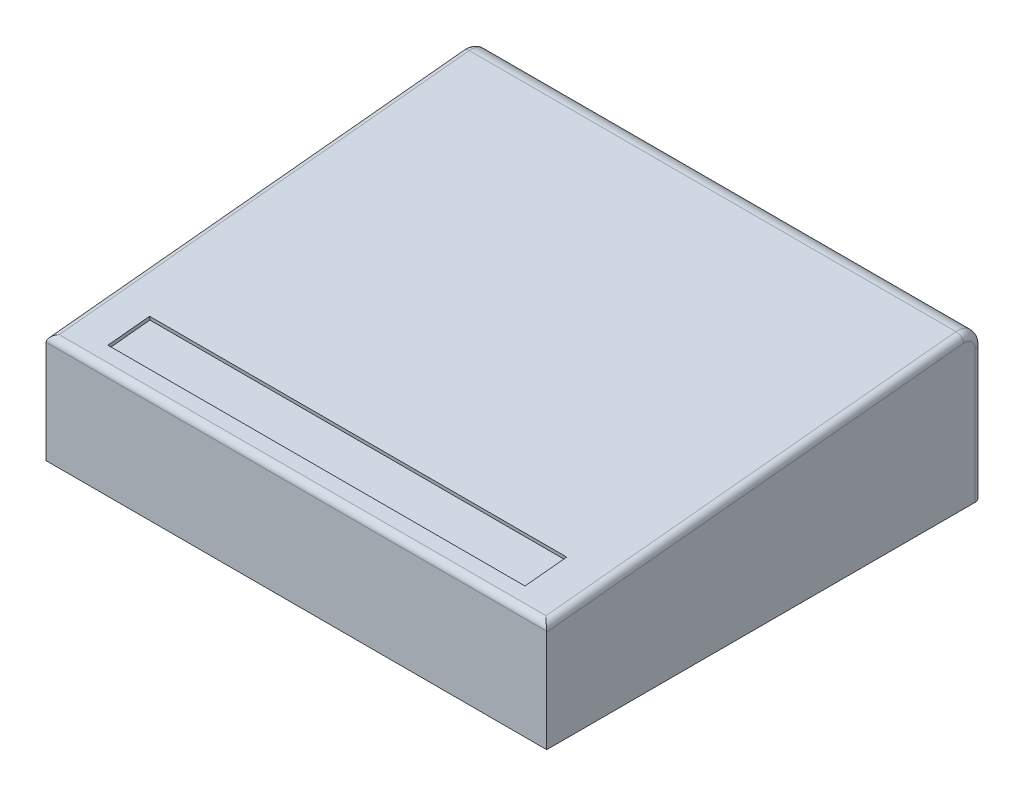
ISO-10303-21;
HEADER;
FILE_DESCRIPTION(('STEP AP214'),'2;1');
FILE_NAME('part.step','',(''),(''),'','','');
FILE_SCHEMA(('AUTOMOTIVE_DESIGN { 1 0 10303 214 1 1 1 1 }'));
ENDSEC;
DATA;
#1=APPLICATION_CONTEXT('core data for automotive mechanical design processes');
#2=APPLICATION_PROTOCOL_DEFINITION('international standard','automotive_design',2000,#1);
#3=PRODUCT_CONTEXT('',#1,'mechanical');
#4=PRODUCT('Part','Part','',(#3));
#5=PRODUCT_RELATED_PRODUCT_CATEGORY('part','',(#4));
#6=PRODUCT_DEFINITION_FORMATION('','',#4);
#7=PRODUCT_DEFINITION_CONTEXT('part definition',#1,'design');
#8=PRODUCT_DEFINITION('design','',#6,#7);
#9=PRODUCT_DEFINITION_SHAPE('','',#8);
#10=(LENGTH_UNIT() NAMED_UNIT(*) SI_UNIT(.MILLI.,.METRE.));
#11=(NAMED_UNIT(*) PLANE_ANGLE_UNIT() SI_UNIT($,.RADIAN.));
#12=(NAMED_UNIT(*) SI_UNIT($,.STERADIAN.) SOLID_ANGLE_UNIT());
#13=UNCERTAINTY_MEASURE_WITH_UNIT(LENGTH_MEASURE(1.E-05),#10,'distance_accuracy_value','');
#14=(GEOMETRIC_REPRESENTATION_CONTEXT(3) GLOBAL_UNCERTAINTY_ASSIGNED_CONTEXT((#13)) GLOBAL_UNIT_ASSIGNED_CONTEXT((#10,
#11,#12)) REPRESENTATION_CONTEXT('',''));
#15=CARTESIAN_POINT('',(0.,0.,0.));
#16=DIRECTION('',(0.,0.,1.));
#17=DIRECTION('',(1.,0.,0.));
#18=AXIS2_PLACEMENT_3D('',#15,#16,#17);
#19=CARTESIAN_POINT('',(18.25625,0.,0.));
#20=DIRECTION('',(0.,0.,-1.));
#21=DIRECTION('',(-1.,0.,0.));
#22=AXIS2_PLACEMENT_3D('',#19,#20,#21);
#23=PLANE('',#22);
#24=DIRECTION('',(0.,-1.,0.));
#25=VECTOR('',#24,1.);
#26=CARTESIAN_POINT('',(18.25625,0.,0.));
#27=LINE('',#26,#25);
#28=CARTESIAN_POINT('',(18.25625,3.71348315922353,0.));
#29=VERTEX_POINT('',#28);
#30=CARTESIAN_POINT('',(18.25625,0.,0.));
#31=VERTEX_POINT('',#30);
#32=EDGE_CURVE('E196',#29,#31,#27,.T.);
#33=ORIENTED_EDGE('',*,*,#32,.F.);
#34=CARTESIAN_POINT('',(18.00225,3.71348315922353,0.));
#35=DIRECTION('',(0.,0.,-1.));
#36=DIRECTION('',(0.,-1.,0.));
#37=AXIS2_PLACEMENT_3D('',#34,#35,#36);
#38=ELLIPSE('',#37,0.255266840776471,0.254);
#39=CARTESIAN_POINT('',(18.2549894463133,3.73888315922353,0.));
#40=VERTEX_POINT('',#39);
#41=EDGE_CURVE('E255',#29,#40,#38,.F.);
#42=ORIENTED_EDGE('',*,*,#41,.T.);
#43=DIRECTION('',(-1.,0.,0.));
#44=VECTOR('',#43,1.);
#45=CARTESIAN_POINT('',(18.25625,3.73888315922353,0.));
#46=LINE('',#45,#44);
#47=CARTESIAN_POINT('',(0.00126055368666195,3.73888315922353,0.));
#48=VERTEX_POINT('',#47);
#49=EDGE_CURVE('E252',#40,#48,#46,.T.);
#50=ORIENTED_EDGE('',*,*,#49,.T.);
#51=CARTESIAN_POINT('',(0.254000000000001,3.71348315922353,0.));
#52=DIRECTION('',(0.,0.,-1.));
#53=DIRECTION('',(0.,1.,0.));
#54=AXIS2_PLACEMENT_3D('',#51,#52,#53);
#55=ELLIPSE('',#54,0.255266840776471,0.254);
#56=CARTESIAN_POINT('',(0.,3.71348315922353,0.));
#57=VERTEX_POINT('',#56);
#58=EDGE_CURVE('E249',#48,#57,#55,.F.);
#59=ORIENTED_EDGE('',*,*,#58,.T.);
#60=DIRECTION('',(0.,-1.,0.));
#61=VECTOR('',#60,1.);
#62=CARTESIAN_POINT('',(0.,0.,0.));
#63=LINE('',#62,#61);
#64=CARTESIAN_POINT('',(0.,0.,0.));
#65=VERTEX_POINT('',#64);
#66=EDGE_CURVE('E205',#57,#65,#63,.T.);
#67=ORIENTED_EDGE('',*,*,#66,.T.);
#68=DIRECTION('',(-1.,0.,0.));
#69=VECTOR('',#68,1.);
#70=CARTESIAN_POINT('',(18.25625,0.,0.));
#71=LINE('',#70,#69);
#72=EDGE_CURVE('E212',#31,#65,#71,.T.);
#73=ORIENTED_EDGE('',*,*,#72,.F.);
#74=EDGE_LOOP('',(#33,#42,#50,#59,#67,#73));
#75=FACE_BOUND('',#74,.T.);
#76=ADVANCED_FACE('F41',(#75),#23,.F.);
#77=CARTESIAN_POINT('',(18.25625,0.,0.));
#78=DIRECTION('',(0.,1.,0.));
#79=DIRECTION('',(0.,0.,1.));
#80=AXIS2_PLACEMENT_3D('',#77,#78,#79);
#81=PLANE('',#80);
#82=DIRECTION('',(-1.,0.,0.));
#83=VECTOR('',#82,1.);
#84=CARTESIAN_POINT('',(18.25625,0.,-15.875));
#85=LINE('',#84,#83);
#86=CARTESIAN_POINT('',(18.00225,0.,-15.875));
#87=VERTEX_POINT('',#86);
#88=CARTESIAN_POINT('',(0.254000000000001,0.,-15.875));
#89=VERTEX_POINT('',#88);
#90=EDGE_CURVE('E204',#87,#89,#85,.T.);
#91=ORIENTED_EDGE('',*,*,#90,.F.);
#92=CARTESIAN_POINT('',(18.00225,0.,-15.621));
#93=DIRECTION('',(0.,1.,0.));
#94=DIRECTION('',(0.,0.,1.));
#95=AXIS2_PLACEMENT_3D('',#92,#93,#94);
#96=CIRCLE('',#95,0.254);
#97=CARTESIAN_POINT('',(18.25625,0.,-15.621));
#98=VERTEX_POINT('',#97);
#99=EDGE_CURVE('E11',#87,#98,#96,.F.);
#100=ORIENTED_EDGE('',*,*,#99,.T.);
#101=DIRECTION('',(0.,0.,-1.));
#102=VECTOR('',#101,1.);
#103=CARTESIAN_POINT('',(18.25625,0.,0.));
#104=LINE('',#103,#102);
#105=EDGE_CURVE('E199',#31,#98,#104,.T.);
#106=ORIENTED_EDGE('',*,*,#105,.F.);
#107=ORIENTED_EDGE('',*,*,#72,.T.);
#108=DIRECTION('',(0.,0.,-1.));
#109=VECTOR('',#108,1.);
#110=CARTESIAN_POINT('',(0.,0.,0.));
#111=LINE('',#110,#109);
#112=CARTESIAN_POINT('',(0.,0.,-15.621));
#113=VERTEX_POINT('',#112);
#114=EDGE_CURVE('E200',#65,#113,#111,.T.);
#115=ORIENTED_EDGE('',*,*,#114,.T.);
#116=CARTESIAN_POINT('',(0.254000000000001,0.,-15.621));
#117=DIRECTION('',(0.,1.,0.));
#118=DIRECTION('',(0.,0.,1.));
#119=AXIS2_PLACEMENT_3D('',#116,#117,#118);
#120=CIRCLE('',#119,0.254);
#121=EDGE_CURVE('E51',#113,#89,#120,.F.);
#122=ORIENTED_EDGE('',*,*,#121,.T.);
#123=EDGE_LOOP('',(#91,#100,#106,#107,#115,#122));
#124=FACE_BOUND('',#123,.T.);
#125=ADVANCED_FACE('F309',(#124),#81,.F.);
#126=CARTESIAN_POINT('',(18.25625,0.,-15.875));
#127=DIRECTION('',(0.,0.,1.));
#128=DIRECTION('',(1.,0.,0.));
#129=AXIS2_PLACEMENT_3D('',#126,#127,#128);
#130=PLANE('',#129);
#131=DIRECTION('',(-1.,0.,0.));
#132=VECTOR('',#131,1.);
#133=CARTESIAN_POINT('',(18.25625,4.85458289805882,-15.875));
#134=LINE('',#133,#132);
#135=CARTESIAN_POINT('',(0.254000000000001,4.85458289805882,-15.875));
#136=VERTEX_POINT('',#135);
#137=CARTESIAN_POINT('',(18.00225,4.85458289805882,-15.875));
#138=VERTEX_POINT('',#137);
#139=EDGE_CURVE('E220',#136,#138,#134,.F.);
#140=ORIENTED_EDGE('',*,*,#139,.T.);
#141=DIRECTION('',(0.,1.,0.));
#142=VECTOR('',#141,1.);
#143=CARTESIAN_POINT('',(18.00225,0.,-15.875));
#144=LINE('',#143,#142);
#145=EDGE_CURVE('E270',#138,#87,#144,.F.);
#146=ORIENTED_EDGE('',*,*,#145,.T.);
#147=ORIENTED_EDGE('',*,*,#90,.T.);
#148=DIRECTION('',(0.,1.,0.));
#149=VECTOR('',#148,1.);
#150=CARTESIAN_POINT('',(0.254000000000001,4.85458289805882,-15.875));
#151=LINE('',#150,#149);
#152=EDGE_CURVE('E267',#89,#136,#151,.T.);
#153=ORIENTED_EDGE('',*,*,#152,.T.);
#154=EDGE_LOOP('',(#140,#146,#147,#153));
#155=FACE_BOUND('',#154,.T.);
#156=ADVANCED_FACE('F347',(#155),#130,.F.);
#157=CARTESIAN_POINT('',(18.25625,3.96875,0.));
#158=DIRECTION('',(0.,-0.995037190209989,-0.0995037190209989));
#159=DIRECTION('',(0.,0.0995037190209989,-0.995037190209989));
#160=AXIS2_PLACEMENT_3D('',#157,#158,#159);
#161=PLANE('',#160);
#162=DIRECTION('',(1.,0.,0.));
#163=VECTOR('',#162,1.);
#164=CARTESIAN_POINT('',(16.73225,4.04194580883947,-0.731958088394647));
#165=LINE('',#164,#163);
#166=CARTESIAN_POINT('',(1.524,4.04194580883946,-0.731958088394647));
#167=VERTEX_POINT('',#166);
#168=CARTESIAN_POINT('',(16.73225,4.04194580883947,-0.731958088394647));
#169=VERTEX_POINT('',#168);
#170=EDGE_CURVE('E181',#167,#169,#165,.T.);
#171=ORIENTED_EDGE('',*,*,#170,.F.);
#172=DIRECTION('',(0.,-0.0995037190209988,0.995037190209989));
#173=VECTOR('',#172,1.);
#174=CARTESIAN_POINT('',(1.524,4.19403884854761,-2.25288848547606));
#175=LINE('',#174,#173);
#176=CARTESIAN_POINT('',(1.524,4.19403884854761,-2.25288848547606));
#177=VERTEX_POINT('',#176);
#178=EDGE_CURVE('E59',#177,#167,#175,.T.);
#179=ORIENTED_EDGE('',*,*,#178,.F.);
#180=DIRECTION('',(-1.,0.,0.));
#181=VECTOR('',#180,1.);
#182=CARTESIAN_POINT('',(16.73225,4.19403884854761,-2.25288848547606));
#183=LINE('',#182,#181);
#184=CARTESIAN_POINT('',(16.73225,4.19403884854761,-2.25288848547606));
#185=VERTEX_POINT('',#184);
#186=EDGE_CURVE('E168',#185,#177,#183,.T.);
#187=ORIENTED_EDGE('',*,*,#186,.F.);
#188=DIRECTION('',(0.,0.0995037190209988,-0.995037190209989));
#189=VECTOR('',#188,1.);
#190=CARTESIAN_POINT('',(16.73225,4.19403884854761,-2.25288848547606));
#191=LINE('',#190,#189);
#192=EDGE_CURVE('E172',#169,#185,#191,.T.);
#193=ORIENTED_EDGE('',*,*,#192,.F.);
#194=EDGE_LOOP('',(#171,#179,#187,#193));
#195=FACE_BOUND('',#194,.T.);
#196=DIRECTION('',(-1.,0.,0.));
#197=VECTOR('',#196,1.);
#198=CARTESIAN_POINT('',(18.25625,3.99162260553687,-0.228726055368666));
#199=LINE('',#198,#197);
#200=CARTESIAN_POINT('',(0.254000000000001,3.99162260553687,-0.228726055368666));
#201=VERTEX_POINT('',#200);
#202=CARTESIAN_POINT('',(18.00225,3.99162260553687,-0.228726055368666));
#203=VERTEX_POINT('',#202);
#204=EDGE_CURVE('E261',#201,#203,#199,.F.);
#205=ORIENTED_EDGE('',*,*,#204,.T.);
#206=DIRECTION('',(0.,-0.0995037190209989,0.995037190209989));
#207=VECTOR('',#206,1.);
#208=CARTESIAN_POINT('',(18.00225,3.96875,0.));
#209=LINE('',#208,#207);
#210=CARTESIAN_POINT('',(18.00225,5.48643151384217,-15.1768151384217));
#211=VERTEX_POINT('',#210);
#212=EDGE_CURVE('E264',#203,#211,#209,.F.);
#213=ORIENTED_EDGE('',*,*,#212,.T.);
#214=DIRECTION('',(-1.,0.,0.));
#215=VECTOR('',#214,1.);
#216=CARTESIAN_POINT('',(18.25625,5.48643151384217,-15.1768151384217));
#217=LINE('',#216,#215);
#218=CARTESIAN_POINT('',(0.254000000000001,5.48643151384217,-15.1768151384217));
#219=VERTEX_POINT('',#218);
#220=EDGE_CURVE('E216',#211,#219,#217,.T.);
#221=ORIENTED_EDGE('',*,*,#220,.T.);
#222=DIRECTION('',(0.,-0.0995037190209989,0.995037190209989));
#223=VECTOR('',#222,1.);
#224=CARTESIAN_POINT('',(0.254000000000001,3.96875,0.));
#225=LINE('',#224,#223);
#226=EDGE_CURVE('E258',#219,#201,#225,.T.);
#227=ORIENTED_EDGE('',*,*,#226,.T.);
#228=EDGE_LOOP('',(#205,#213,#221,#227));
#229=FACE_BOUND('',#228,.T.);
#230=ADVANCED_FACE('F325',(#195,#229),#161,.F.);
#231=CARTESIAN_POINT('',(18.25625,0.,0.));
#232=DIRECTION('',(-1.,0.,0.));
#233=DIRECTION('',(0.,0.,1.));
#234=AXIS2_PLACEMENT_3D('',#231,#232,#233);
#235=PLANE('',#234);
#236=CARTESIAN_POINT('',(18.25625,4.85458289805882,-15.24));
#237=DIRECTION('',(-1.,0.,0.));
#238=DIRECTION('',(0.,0.,1.));
#239=AXIS2_PLACEMENT_3D('',#236,#237,#238);
#240=CIRCLE('',#239,0.381);
#241=CARTESIAN_POINT('',(18.25625,4.85458289805882,-15.621));
#242=VERTEX_POINT('',#241);
#243=CARTESIAN_POINT('',(18.25625,5.23369206752883,-15.202089083053));
#244=VERTEX_POINT('',#243);
#245=EDGE_CURVE('E227',#242,#244,#240,.F.);
#246=ORIENTED_EDGE('',*,*,#245,.T.);
#247=DIRECTION('',(0.,-0.0995037190209989,0.995037190209989));
#248=VECTOR('',#247,1.);
#249=CARTESIAN_POINT('',(18.25625,3.67671599923122,0.367671599923122));
#250=LINE('',#249,#248);
#251=EDGE_CURVE('E231',#244,#29,#250,.T.);
#252=ORIENTED_EDGE('',*,*,#251,.T.);
#253=ORIENTED_EDGE('',*,*,#32,.T.);
#254=ORIENTED_EDGE('',*,*,#105,.T.);
#255=DIRECTION('',(0.,1.,0.));
#256=VECTOR('',#255,1.);
#257=CARTESIAN_POINT('',(18.25625,0.,-15.621));
#258=LINE('',#257,#256);
#259=EDGE_CURVE('E224',#98,#242,#258,.T.);
#260=ORIENTED_EDGE('',*,*,#259,.T.);
#261=EDGE_LOOP('',(#246,#252,#253,#254,#260));
#262=FACE_BOUND('',#261,.T.);
#263=ADVANCED_FACE('F340',(#262),#235,.F.);
#264=CARTESIAN_POINT('',(0.,0.,0.));
#265=DIRECTION('',(-1.,0.,0.));
#266=DIRECTION('',(0.,0.,1.));
#267=AXIS2_PLACEMENT_3D('',#264,#265,#266);
#268=PLANE('',#267);
#269=ORIENTED_EDGE('',*,*,#66,.F.);
#270=DIRECTION('',(0.,-0.0995037190209989,0.995037190209989));
#271=VECTOR('',#270,1.);
#272=CARTESIAN_POINT('',(0.,5.23369206752883,-15.202089083053));
#273=LINE('',#272,#271);
#274=CARTESIAN_POINT('',(0.,5.23369206752883,-15.202089083053));
#275=VERTEX_POINT('',#274);
#276=EDGE_CURVE('E246',#57,#275,#273,.F.);
#277=ORIENTED_EDGE('',*,*,#276,.T.);
#278=CARTESIAN_POINT('',(0.,4.85458289805882,-15.24));
#279=DIRECTION('',(-1.,0.,0.));
#280=DIRECTION('',(0.,0.,1.));
#281=AXIS2_PLACEMENT_3D('',#278,#279,#280);
#282=CIRCLE('',#281,0.381);
#283=CARTESIAN_POINT('',(0.,4.85458289805882,-15.621));
#284=VERTEX_POINT('',#283);
#285=EDGE_CURVE('E243',#275,#284,#282,.T.);
#286=ORIENTED_EDGE('',*,*,#285,.T.);
#287=DIRECTION('',(0.,1.,0.));
#288=VECTOR('',#287,1.);
#289=CARTESIAN_POINT('',(0.,0.,-15.621));
#290=LINE('',#289,#288);
#291=EDGE_CURVE('E240',#284,#113,#290,.F.);
#292=ORIENTED_EDGE('',*,*,#291,.T.);
#293=ORIENTED_EDGE('',*,*,#114,.F.);
#294=EDGE_LOOP('',(#269,#277,#286,#292,#293));
#295=FACE_BOUND('',#294,.T.);
#296=ADVANCED_FACE('F308',(#295),#268,.T.);
#297=CARTESIAN_POINT('',(18.25625,4.85458289805882,-15.24));
#298=DIRECTION('',(-1.,0.,0.));
#299=DIRECTION('',(0.,0.,1.));
#300=AXIS2_PLACEMENT_3D('',#297,#298,#299);
#301=CYLINDRICAL_SURFACE('',#300,0.635);
#302=ORIENTED_EDGE('',*,*,#220,.F.);
#303=CARTESIAN_POINT('',(18.00225,4.85458289805882,-15.24));
#304=DIRECTION('',(-1.,0.,0.));
#305=DIRECTION('',(0.,0.,1.));
#306=AXIS2_PLACEMENT_3D('',#303,#304,#305);
#307=CIRCLE('',#306,0.635);
#308=EDGE_CURVE('E237',#211,#138,#307,.T.);
#309=ORIENTED_EDGE('',*,*,#308,.T.);
#310=ORIENTED_EDGE('',*,*,#139,.F.);
#311=CARTESIAN_POINT('',(0.254000000000001,4.85458289805882,-15.24));
#312=DIRECTION('',(-1.,0.,0.));
#313=DIRECTION('',(0.,0.,1.));
#314=AXIS2_PLACEMENT_3D('',#311,#312,#313);
#315=CIRCLE('',#314,0.635);
#316=EDGE_CURVE('E234',#136,#219,#315,.F.);
#317=ORIENTED_EDGE('',*,*,#316,.T.);
#318=EDGE_LOOP('',(#302,#309,#310,#317));
#319=FACE_BOUND('',#318,.T.);
#320=ADVANCED_FACE('F329',(#319),#301,.T.);
#321=CARTESIAN_POINT('',(0.254000000000001,0.,-15.621));
#322=DIRECTION('',(0.,-1.,0.));
#323=DIRECTION('',(0.,0.,-1.));
#324=AXIS2_PLACEMENT_3D('',#321,#322,#323);
#325=CYLINDRICAL_SURFACE('',#324,0.254);
#326=ORIENTED_EDGE('',*,*,#121,.F.);
#327=ORIENTED_EDGE('',*,*,#291,.F.);
#328=CARTESIAN_POINT('',(0.254000000000001,4.85458289805882,-15.621));
#329=DIRECTION('',(0.,1.,0.));
#330=DIRECTION('',(0.,0.,1.));
#331=AXIS2_PLACEMENT_3D('',#328,#329,#330);
#332=CIRCLE('',#331,0.254);
#333=EDGE_CURVE('E45',#136,#284,#332,.T.);
#334=ORIENTED_EDGE('',*,*,#333,.F.);
#335=ORIENTED_EDGE('',*,*,#152,.F.);
#336=EDGE_LOOP('',(#326,#327,#334,#335));
#337=FACE_BOUND('',#336,.T.);
#338=ADVANCED_FACE('F43',(#337),#325,.T.);
#339=CARTESIAN_POINT('',(0.254000000000001,4.85458289805882,-15.24));
#340=DIRECTION('',(-1.,0.,0.));
#341=DIRECTION('',(0.,0.,1.));
#342=AXIS2_PLACEMENT_3D('',#339,#340,#341);
#343=TOROIDAL_SURFACE('',#342,0.381,0.254);
#344=ORIENTED_EDGE('',*,*,#333,.T.);
#345=ORIENTED_EDGE('',*,*,#285,.F.);
#346=CARTESIAN_POINT('',(0.254000000000001,5.23369206752883,-15.202089083053));
#347=DIRECTION('',(0.,-0.099503719021001,0.995037190209989));
#348=DIRECTION('',(0.,-0.995037190209989,-0.099503719021001));
#349=AXIS2_PLACEMENT_3D('',#346,#347,#348);
#350=CIRCLE('',#349,0.254);
#351=EDGE_CURVE('E288',#219,#275,#350,.T.);
#352=ORIENTED_EDGE('',*,*,#351,.F.);
#353=ORIENTED_EDGE('',*,*,#316,.F.);
#354=EDGE_LOOP('',(#344,#345,#352,#353));
#355=FACE_BOUND('',#354,.T.);
#356=ADVANCED_FACE('F301',(#355),#343,.T.);
#357=CARTESIAN_POINT('',(0.254000000000001,3.71601055368666,-0.0252739446313337));
#358=DIRECTION('',(0.,0.0995037190209989,-0.995037190209989));
#359=DIRECTION('',(0.,0.995037190209989,0.0995037190209989));
#360=AXIS2_PLACEMENT_3D('',#357,#358,#359);
#361=CYLINDRICAL_SURFACE('',#360,0.254);
#362=ORIENTED_EDGE('',*,*,#276,.F.);
#363=ORIENTED_EDGE('',*,*,#58,.F.);
#364=CARTESIAN_POINT('',(0.254000000000001,3.73888315922353,-0.254));
#365=DIRECTION('',(-0.707106781186547,0.0703597544730292,-0.703597544730292));
#366=DIRECTION('',(0.707106781186547,0.0703597544730292,-0.703597544730292));
#367=AXIS2_PLACEMENT_3D('',#364,#365,#366);
#368=ELLIPSE('',#367,0.359210244842766,0.254);
#369=EDGE_CURVE('E285',#201,#48,#368,.F.);
#370=ORIENTED_EDGE('',*,*,#369,.F.);
#371=ORIENTED_EDGE('',*,*,#226,.F.);
#372=ORIENTED_EDGE('',*,*,#351,.T.);
#373=EDGE_LOOP('',(#362,#363,#370,#371,#372));
#374=FACE_BOUND('',#373,.T.);
#375=ADVANCED_FACE('F316',(#374),#361,.T.);
#376=CARTESIAN_POINT('',(18.25625,3.73888315922353,-0.254));
#377=DIRECTION('',(-1.,0.,0.));
#378=DIRECTION('',(0.,0.,1.));
#379=AXIS2_PLACEMENT_3D('',#376,#377,#378);
#380=CYLINDRICAL_SURFACE('',#379,0.254);
#381=ORIENTED_EDGE('',*,*,#369,.T.);
#382=ORIENTED_EDGE('',*,*,#49,.F.);
#383=CARTESIAN_POINT('',(18.00225,3.73888315922353,-0.254));
#384=DIRECTION('',(-0.707106781186547,-0.0703597544730292,0.703597544730292));
#385=DIRECTION('',(0.707106781186547,-0.0703597544730292,0.703597544730292));
#386=AXIS2_PLACEMENT_3D('',#383,#384,#385);
#387=ELLIPSE('',#386,0.359210244842766,0.254);
#388=EDGE_CURVE('E281',#203,#40,#387,.F.);
#389=ORIENTED_EDGE('',*,*,#388,.F.);
#390=ORIENTED_EDGE('',*,*,#204,.F.);
#391=EDGE_LOOP('',(#381,#382,#389,#390));
#392=FACE_BOUND('',#391,.T.);
#393=ADVANCED_FACE('F321',(#392),#380,.T.);
#394=CARTESIAN_POINT('',(18.00225,0.,-15.621));
#395=DIRECTION('',(0.,1.,0.));
#396=DIRECTION('',(0.,0.,1.));
#397=AXIS2_PLACEMENT_3D('',#394,#395,#396);
#398=CYLINDRICAL_SURFACE('',#397,0.254);
#399=ORIENTED_EDGE('',*,*,#99,.F.);
#400=ORIENTED_EDGE('',*,*,#145,.F.);
#401=CARTESIAN_POINT('',(18.00225,4.85458289805882,-15.621));
#402=DIRECTION('',(0.,1.,0.));
#403=DIRECTION('',(0.,0.,1.));
#404=AXIS2_PLACEMENT_3D('',#401,#402,#403);
#405=CIRCLE('',#404,0.254);
#406=EDGE_CURVE('E277',#242,#138,#405,.T.);
#407=ORIENTED_EDGE('',*,*,#406,.F.);
#408=ORIENTED_EDGE('',*,*,#259,.F.);
#409=EDGE_LOOP('',(#399,#400,#407,#408));
#410=FACE_BOUND('',#409,.T.);
#411=ADVANCED_FACE('F345',(#410),#398,.T.);
#412=CARTESIAN_POINT('',(18.00225,3.67671599923122,0.367671599923122));
#413=DIRECTION('',(0.,-0.0995037190209989,0.995037190209989));
#414=DIRECTION('',(0.,-0.995037190209989,-0.0995037190209989));
#415=AXIS2_PLACEMENT_3D('',#412,#413,#414);
#416=CYLINDRICAL_SURFACE('',#415,0.254);
#417=ORIENTED_EDGE('',*,*,#41,.F.);
#418=ORIENTED_EDGE('',*,*,#251,.F.);
#419=CARTESIAN_POINT('',(18.00225,5.23369206752883,-15.202089083053));
#420=DIRECTION('',(0.,0.099503719021001,-0.995037190209989));
#421=DIRECTION('',(0.,0.995037190209989,0.099503719021001));
#422=AXIS2_PLACEMENT_3D('',#419,#420,#421);
#423=CIRCLE('',#422,0.254);
#424=EDGE_CURVE('E190',#211,#244,#423,.T.);
#425=ORIENTED_EDGE('',*,*,#424,.F.);
#426=ORIENTED_EDGE('',*,*,#212,.F.);
#427=ORIENTED_EDGE('',*,*,#388,.T.);
#428=EDGE_LOOP('',(#417,#418,#425,#426,#427));
#429=FACE_BOUND('',#428,.T.);
#430=ADVANCED_FACE('F338',(#429),#416,.T.);
#431=CARTESIAN_POINT('',(18.00225,4.85458289805882,-15.24));
#432=DIRECTION('',(-1.,0.,0.));
#433=DIRECTION('',(0.,0.,1.));
#434=AXIS2_PLACEMENT_3D('',#431,#432,#433);
#435=TOROIDAL_SURFACE('',#434,0.381,0.254);
#436=ORIENTED_EDGE('',*,*,#406,.T.);
#437=ORIENTED_EDGE('',*,*,#308,.F.);
#438=ORIENTED_EDGE('',*,*,#424,.T.);
#439=ORIENTED_EDGE('',*,*,#245,.F.);
#440=EDGE_LOOP('',(#436,#437,#438,#439));
#441=FACE_BOUND('',#440,.T.);
#442=ADVANCED_FACE('F333',(#441),#435,.T.);
#443=CARTESIAN_POINT('',(1.524,4.06766912539094,-2.26552545779173));
#444=DIRECTION('',(-1.,0.,0.));
#445=DIRECTION('',(0.,0.,1.));
#446=AXIS2_PLACEMENT_3D('',#443,#444,#445);
#447=PLANE('',#446);
#448=ORIENTED_EDGE('',*,*,#178,.T.);
#449=DIRECTION('',(0.,0.995037190209989,0.0995037190209989));
#450=VECTOR('',#449,1.);
#451=CARTESIAN_POINT('',(1.524,3.9155760856828,-0.744595060710314));
#452=LINE('',#451,#450);
#453=CARTESIAN_POINT('',(1.524,3.9155760856828,-0.744595060710314));
#454=VERTEX_POINT('',#453);
#455=EDGE_CURVE('E143',#454,#167,#452,.T.);
#456=ORIENTED_EDGE('',*,*,#455,.F.);
#457=DIRECTION('',(0.,-0.0995037190209988,0.995037190209989));
#458=VECTOR('',#457,1.);
#459=CARTESIAN_POINT('',(1.524,4.06766912539094,-2.26552545779173));
#460=LINE('',#459,#458);
#461=CARTESIAN_POINT('',(1.524,4.06766912539094,-2.26552545779173));
#462=VERTEX_POINT('',#461);
#463=EDGE_CURVE('E147',#462,#454,#460,.T.);
#464=ORIENTED_EDGE('',*,*,#463,.F.);
#465=DIRECTION('',(0.,0.995037190209989,0.0995037190209989));
#466=VECTOR('',#465,1.);
#467=CARTESIAN_POINT('',(1.524,4.06766912539094,-2.26552545779173));
#468=LINE('',#467,#466);
#469=EDGE_CURVE('E187',#462,#177,#468,.T.);
#470=ORIENTED_EDGE('',*,*,#469,.T.);
#471=EDGE_LOOP('',(#448,#456,#464,#470));
#472=FACE_BOUND('',#471,.T.);
#473=ADVANCED_FACE('F145',(#472),#447,.F.);
#474=CARTESIAN_POINT('',(16.73225,4.06766912539094,-2.26552545779173));
#475=DIRECTION('',(0.,0.0995037190209989,-0.995037190209989));
#476=DIRECTION('',(0.,0.995037190209989,0.0995037190209989));
#477=AXIS2_PLACEMENT_3D('',#474,#475,#476);
#478=PLANE('',#477);
#479=ORIENTED_EDGE('',*,*,#186,.T.);
#480=ORIENTED_EDGE('',*,*,#469,.F.);
#481=DIRECTION('',(-1.,0.,0.));
#482=VECTOR('',#481,1.);
#483=CARTESIAN_POINT('',(16.73225,4.06766912539094,-2.26552545779173));
#484=LINE('',#483,#482);
#485=CARTESIAN_POINT('',(16.73225,4.06766912539094,-2.26552545779173));
#486=VERTEX_POINT('',#485);
#487=EDGE_CURVE('E154',#486,#462,#484,.T.);
#488=ORIENTED_EDGE('',*,*,#487,.F.);
#489=DIRECTION('',(0.,0.995037190209989,0.0995037190209989));
#490=VECTOR('',#489,1.);
#491=CARTESIAN_POINT('',(16.73225,4.06766912539094,-2.26552545779173));
#492=LINE('',#491,#490);
#493=EDGE_CURVE('E191',#486,#185,#492,.T.);
#494=ORIENTED_EDGE('',*,*,#493,.T.);
#495=EDGE_LOOP('',(#479,#480,#488,#494));
#496=FACE_BOUND('',#495,.T.);
#497=ADVANCED_FACE('F413',(#496),#478,.F.);
#498=CARTESIAN_POINT('',(16.73225,4.06766912539094,-2.26552545779173));
#499=DIRECTION('',(1.,0.,0.));
#500=DIRECTION('',(0.,0.,-1.));
#501=AXIS2_PLACEMENT_3D('',#498,#499,#500);
#502=PLANE('',#501);
#503=ORIENTED_EDGE('',*,*,#192,.T.);
#504=ORIENTED_EDGE('',*,*,#493,.F.);
#505=DIRECTION('',(0.,0.0995037190209988,-0.995037190209989));
#506=VECTOR('',#505,1.);
#507=CARTESIAN_POINT('',(16.73225,4.06766912539094,-2.26552545779173));
#508=LINE('',#507,#506);
#509=CARTESIAN_POINT('',(16.73225,3.9155760856828,-0.744595060710314));
#510=VERTEX_POINT('',#509);
#511=EDGE_CURVE('E163',#510,#486,#508,.T.);
#512=ORIENTED_EDGE('',*,*,#511,.F.);
#513=DIRECTION('',(0.,0.995037190209989,0.0995037190209989));
#514=VECTOR('',#513,1.);
#515=CARTESIAN_POINT('',(16.73225,3.9155760856828,-0.744595060710314));
#516=LINE('',#515,#514);
#517=EDGE_CURVE('E153',#510,#169,#516,.T.);
#518=ORIENTED_EDGE('',*,*,#517,.T.);
#519=EDGE_LOOP('',(#503,#504,#512,#518));
#520=FACE_BOUND('',#519,.T.);
#521=ADVANCED_FACE('F422',(#520),#502,.F.);
#522=CARTESIAN_POINT('',(16.73225,3.9155760856828,-0.744595060710314));
#523=DIRECTION('',(0.,-0.0995037190209989,0.995037190209989));
#524=DIRECTION('',(0.,-0.995037190209989,-0.0995037190209989));
#525=AXIS2_PLACEMENT_3D('',#522,#523,#524);
#526=PLANE('',#525);
#527=ORIENTED_EDGE('',*,*,#170,.T.);
#528=ORIENTED_EDGE('',*,*,#517,.F.);
#529=DIRECTION('',(1.,0.,0.));
#530=VECTOR('',#529,1.);
#531=CARTESIAN_POINT('',(16.73225,3.9155760856828,-0.744595060710314));
#532=LINE('',#531,#530);
#533=EDGE_CURVE('E157',#454,#510,#532,.T.);
#534=ORIENTED_EDGE('',*,*,#533,.F.);
#535=ORIENTED_EDGE('',*,*,#455,.T.);
#536=EDGE_LOOP('',(#527,#528,#534,#535));
#537=FACE_BOUND('',#536,.T.);
#538=ADVANCED_FACE('F158',(#537),#526,.F.);
#539=CARTESIAN_POINT('',(0.,3.80308572238789,0.380308572238789));
#540=DIRECTION('',(0.,-0.995037190209989,-0.0995037190209988));
#541=DIRECTION('',(0.,0.0995037190209988,-0.995037190209989));
#542=AXIS2_PLACEMENT_3D('',#539,#540,#541);
#543=PLANE('',#542);
#544=ORIENTED_EDGE('',*,*,#463,.T.);
#545=ORIENTED_EDGE('',*,*,#533,.T.);
#546=ORIENTED_EDGE('',*,*,#511,.T.);
#547=ORIENTED_EDGE('',*,*,#487,.T.);
#548=EDGE_LOOP('',(#544,#545,#546,#547));
#549=FACE_BOUND('',#548,.T.);
#550=ADVANCED_FACE('F165',(#549),#543,.F.);
#551=CLOSED_SHELL('',(#76,#125,#156,#230,#263,#296,#320,#338,#356,#375,#393,#411,#430,#442,#473,
#497,#521,#538,#550));
#552=MANIFOLD_SOLID_BREP('B2',#551);
#553=ADVANCED_BREP_SHAPE_REPRESENTATION('',(#18,#552),#14);
#554=SHAPE_DEFINITION_REPRESENTATION(#9,#553);
ENDSEC;
END-ISO-10303-21;
